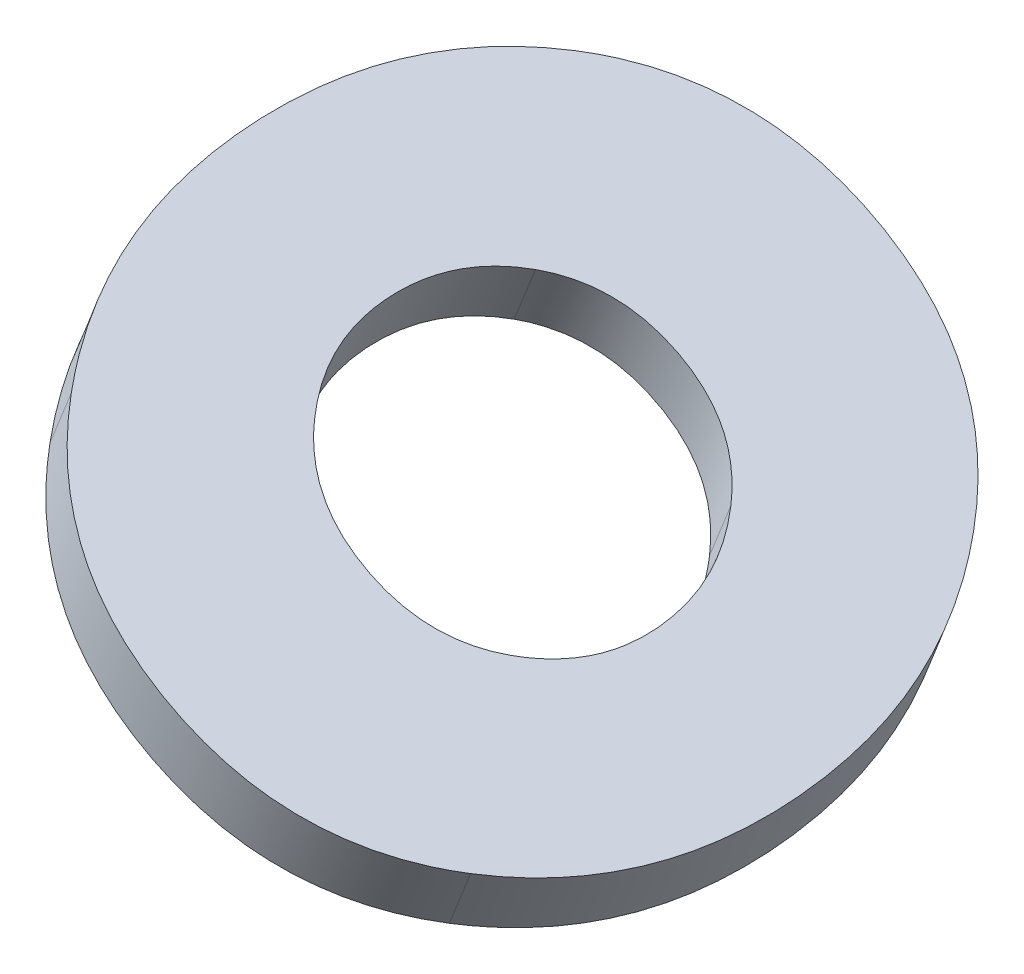
ISO-10303-21;
HEADER;
FILE_DESCRIPTION(('STEP AP214'),'2;1');
FILE_NAME('part.step','',(''),(''),'','','');
FILE_SCHEMA(('AUTOMOTIVE_DESIGN { 1 0 10303 214 1 1 1 1 }'));
ENDSEC;
DATA;
#1=APPLICATION_CONTEXT('core data for automotive mechanical design processes');
#2=APPLICATION_PROTOCOL_DEFINITION('international standard','automotive_design',2000,#1);
#3=PRODUCT_CONTEXT('',#1,'mechanical');
#4=PRODUCT('Part','Part','',(#3));
#5=PRODUCT_RELATED_PRODUCT_CATEGORY('part','',(#4));
#6=PRODUCT_DEFINITION_FORMATION('','',#4);
#7=PRODUCT_DEFINITION_CONTEXT('part definition',#1,'design');
#8=PRODUCT_DEFINITION('design','',#6,#7);
#9=PRODUCT_DEFINITION_SHAPE('','',#8);
#10=(LENGTH_UNIT() NAMED_UNIT(*) SI_UNIT(.MILLI.,.METRE.));
#11=(NAMED_UNIT(*) PLANE_ANGLE_UNIT() SI_UNIT($,.RADIAN.));
#12=(NAMED_UNIT(*) SI_UNIT($,.STERADIAN.) SOLID_ANGLE_UNIT());
#13=UNCERTAINTY_MEASURE_WITH_UNIT(LENGTH_MEASURE(1.E-05),#10,'distance_accuracy_value','');
#14=(GEOMETRIC_REPRESENTATION_CONTEXT(3) GLOBAL_UNCERTAINTY_ASSIGNED_CONTEXT((#13)) GLOBAL_UNIT_ASSIGNED_CONTEXT((#10,
#11,#12)) REPRESENTATION_CONTEXT('',''));
#15=CARTESIAN_POINT('',(0.,0.,0.));
#16=DIRECTION('',(0.,0.,1.));
#17=DIRECTION('',(1.,0.,0.));
#18=AXIS2_PLACEMENT_3D('',#15,#16,#17);
#19=CARTESIAN_POINT('',(3.98840341875596,7.59742136184228,1.56870581639864));
#20=CARTESIAN_POINT('',(3.98454172250193,7.59859341821891,1.5723983942653));
#21=CARTESIAN_POINT('',(3.93095712458151,7.61453372846904,1.62485927126845));
#22=CARTESIAN_POINT('',(3.8701626621407,7.6258530152977,1.70999151573043));
#23=CARTESIAN_POINT('',(3.82449729426318,7.61913640139894,1.83155130656556));
#24=CARTESIAN_POINT('',(3.80577850812356,7.60343258203057,1.9304060214411));
#25=CARTESIAN_POINT('',(3.80359954941392,7.57884733920706,2.02806318926111));
#26=CARTESIAN_POINT('',(3.82403076189053,7.53651426311101,2.14530846126991));
#27=CARTESIAN_POINT('',(3.86704977882298,7.4907771970366,2.22788875573318));
#28=CARTESIAN_POINT('',(3.90972979560977,7.45353372467327,2.27902928680717));
#29=CARTESIAN_POINT('',(3.91287913451842,7.45081476499334,2.28269231112175));
#30=(BOUNDED_CURVE() B_SPLINE_CURVE(3,(#19,#20,#21,#22,#23,#24,#25,#26,#27,#28,#29),
.UNSPECIFIED.,.F.,.F.) B_SPLINE_CURVE_WITH_KNOTS((4,1,1,1,1,1,1,1,4),(0.,0.01874487802913,
0.2642575080465,0.3870138230553,0.509770138064,0.6277397872326,0.7457094364012,0.9816487347385,
1.),.UNSPECIFIED.) CURVE() GEOMETRIC_REPRESENTATION_ITEM() RATIONAL_B_SPLINE_CURVE((1.,1.,1.,1.,
1.,1.,1.,1.,1.,1.,1.)) REPRESENTATION_ITEM(''));
#31=DIRECTION('',(-0.473549457311715,-0.851557509516818,-0.224946036785035));
#32=VECTOR('',#31,1.);
#33=SURFACE_OF_LINEAR_EXTRUSION('',#30,#32);
#34=DIRECTION('',(-0.473549457311715,-0.851557509516818,-0.224946036785035));
#35=VECTOR('',#34,1.);
#36=CARTESIAN_POINT('',(4.01488447409671,7.66893812649616,1.59786513260996));
#37=LINE('',#36,#35);
#38=CARTESIAN_POINT('',(4.01488447409671,7.66893812649616,1.59786513260996));
#39=VERTEX_POINT('',#38);
#40=CARTESIAN_POINT('',(3.87440631171502,7.41632410223279,1.5311350257648));
#41=VERTEX_POINT('',#40);
#42=EDGE_CURVE('E11',#39,#41,#37,.T.);
#43=ORIENTED_EDGE('',*,*,#42,.F.);
#44=CARTESIAN_POINT('',(3.94152284960082,7.52700253828279,2.28961625524368));
#45=CARTESIAN_POINT('',(3.90281303229783,7.56115649223782,2.24181348820375));
#46=CARTESIAN_POINT('',(3.86191471847543,7.60463886387229,2.16330414421274));
#47=CARTESIAN_POINT('',(3.84148350599882,7.64697193996833,2.04605887220394));
#48=CARTESIAN_POINT('',(3.84366246470846,7.67155718279185,1.94840170438393));
#49=CARTESIAN_POINT('',(3.86238125084808,7.68726100216021,1.84954698950839));
#50=CARTESIAN_POINT('',(3.90804661872608,7.69397761605986,1.72798719867324));
#51=CARTESIAN_POINT('',(3.96589652281886,7.68320657489593,1.64697830444759));
#52=CARTESIAN_POINT('',(4.01488447409671,7.66893812649616,1.59786513260996));
#53=B_SPLINE_CURVE_WITH_KNOTS('',3,(#44,#45,#46,#47,#48,#49,#50,#51,#52),.UNSPECIFIED.,.F.,.F.,
(4,1,1,1,1,1,4),(0.,0.2450289265053,0.3675433897579,0.4900578530105,0.6175433897579,
0.7450289265053,1.),.UNSPECIFIED.);
#54=CARTESIAN_POINT('',(3.94152284960082,7.52700253828279,2.28961625524368));
#55=VERTEX_POINT('',#54);
#56=EDGE_CURVE('E140',#55,#39,#53,.T.);
#57=ORIENTED_EDGE('',*,*,#56,.F.);
#58=DIRECTION('',(0.473549457311715,0.851557509516818,0.224946036785035));
#59=VECTOR('',#58,1.);
#60=CARTESIAN_POINT('',(3.80104468721914,7.27438851401942,2.22288614839853));
#61=LINE('',#60,#59);
#62=CARTESIAN_POINT('',(3.80104468721914,7.27438851401942,2.22288614839853));
#63=VERTEX_POINT('',#62);
#64=EDGE_CURVE('E134',#63,#55,#61,.T.);
#65=ORIENTED_EDGE('',*,*,#64,.F.);
#66=CARTESIAN_POINT('',(3.87440631171502,7.41632410223279,1.5311350257648));
#67=CARTESIAN_POINT('',(3.8254183604367,7.4305925506317,1.58024819760346));
#68=CARTESIAN_POINT('',(3.76756845634391,7.44136359179561,1.66125709182811));
#69=CARTESIAN_POINT('',(3.72190308846641,7.43464697789685,1.78281688266424));
#70=CARTESIAN_POINT('',(3.70318430232679,7.41894315852849,1.88167159753978));
#71=CARTESIAN_POINT('',(3.70100534361666,7.3943579157041,1.97932876535981));
#72=CARTESIAN_POINT('',(3.72143655609327,7.35202483960805,2.09657403736861));
#73=CARTESIAN_POINT('',(3.76233486991566,7.30854246797357,2.17508338135861));
#74=CARTESIAN_POINT('',(3.80104468721914,7.27438851401942,2.22288614839853));
#75=B_SPLINE_CURVE_WITH_KNOTS('',3,(#66,#67,#68,#69,#70,#71,#72,#73,#74),.UNSPECIFIED.,.F.,.F.,
(4,1,1,1,1,1,4),(0.,0.2549710734947,0.3824566102421,0.5099421469895,0.6324566102421,
0.7549710734947,1.),.UNSPECIFIED.);
#76=EDGE_CURVE('E117',#41,#63,#75,.T.);
#77=ORIENTED_EDGE('',*,*,#76,.F.);
#78=EDGE_LOOP('',(#43,#57,#65,#77));
#79=FACE_BOUND('',#78,.T.);
#80=ADVANCED_FACE('F17',(#79),#33,.T.);
#81=CARTESIAN_POINT('',(4.65860554349506,7.21958360829606,1.58816258929639));
#82=CARTESIAN_POINT('',(4.6557656893121,7.22218705355856,1.58428533958281));
#83=CARTESIAN_POINT('',(4.61491935851723,7.25913869948266,1.53038932982162));
#84=CARTESIAN_POINT('',(4.54215957492464,7.31488574383891,1.47252452630459));
#85=CARTESIAN_POINT('',(4.42840485974139,7.38770802771996,1.43632082530262));
#86=CARTESIAN_POINT('',(4.32944787653727,7.44497821184412,1.42783954820647));
#87=CARTESIAN_POINT('',(4.22853265952526,7.49847246132611,1.43777489279443));
#88=CARTESIAN_POINT('',(4.10694402567188,7.55618720551523,1.47525413836206));
#89=CARTESIAN_POINT('',(4.02180141003117,7.58812741832083,1.53358062211914));
#90=CARTESIAN_POINT('',(3.96947612799486,7.60297600361062,1.58752326888085));
#91=CARTESIAN_POINT('',(3.96575896255466,7.60400353355732,1.59145870534027));
#92=(BOUNDED_CURVE() B_SPLINE_CURVE(3,(#81,#82,#83,#84,#85,#86,#87,#88,#89,#90,#91),
.UNSPECIFIED.,.F.,.F.) B_SPLINE_CURVE_WITH_KNOTS((4,1,1,1,1,1,1,1,4),(0.,0.01828981753048,
0.2590324096191,0.3794037056635,0.4997750017078,0.6201870218203,0.7405990419328,0.9814230821579,
1.),.UNSPECIFIED.) CURVE() GEOMETRIC_REPRESENTATION_ITEM() RATIONAL_B_SPLINE_CURVE((1.,1.,1.,1.,
1.,1.,1.,1.,1.,1.,1.)) REPRESENTATION_ITEM(''));
#93=DIRECTION('',(-0.473549457311715,-0.851557509516818,-0.224946036785035));
#94=VECTOR('',#93,1.);
#95=SURFACE_OF_LINEAR_EXTRUSION('',#92,#94);
#96=DIRECTION('',(-0.473549457311715,-0.851557509516818,-0.224946036785035));
#97=VECTOR('',#96,1.);
#98=CARTESIAN_POINT('',(4.68783745345294,7.29553536242519,1.59474175972551));
#99=LINE('',#98,#97);
#100=CARTESIAN_POINT('',(4.68783745345294,7.29553536242519,1.59474175972551));
#101=VERTEX_POINT('',#100);
#102=CARTESIAN_POINT('',(4.54735929107125,7.04292133816182,1.52801165288036));
#103=VERTEX_POINT('',#102);
#104=EDGE_CURVE('E30',#101,#103,#99,.T.);
#105=ORIENTED_EDGE('',*,*,#104,.F.);
#106=CARTESIAN_POINT('',(4.01488447409671,7.66893812649616,1.59786513260996));
#107=CARTESIAN_POINT('',(4.06384975136949,7.65468980098143,1.54872351603399));
#108=CARTESIAN_POINT('',(4.14482798225678,7.62431180627651,1.49324982130488));
#109=CARTESIAN_POINT('',(4.26641661611016,7.56659706208739,1.45577057573726));
#110=CARTESIAN_POINT('',(4.36733183312265,7.51310281260627,1.44583523114928));
#111=CARTESIAN_POINT('',(4.46628881632629,7.45583262848123,1.45431650824544));
#112=CARTESIAN_POINT('',(4.58004353150954,7.38301034460019,1.49052020924742));
#113=CARTESIAN_POINT('',(4.64929580279876,7.3299506837718,1.54559553896138));
#114=CARTESIAN_POINT('',(4.68783745345294,7.29553536242519,1.59474175972551));
#115=B_SPLINE_CURVE_WITH_KNOTS('',3,(#106,#107,#108,#109,#110,#111,#112,#113,#114),
.UNSPECIFIED.,.F.,.F.,(4,1,1,1,1,1,4),(0.,0.2500422829007,0.3750634243511,0.5000845658014,
0.6250634243511,0.7500422829007,1.),.UNSPECIFIED.);
#116=EDGE_CURVE('E174',#39,#101,#115,.T.);
#117=ORIENTED_EDGE('',*,*,#116,.F.);
#118=ORIENTED_EDGE('',*,*,#42,.T.);
#119=CARTESIAN_POINT('',(4.54735929107125,7.04292133816182,1.52801165288036));
#120=CARTESIAN_POINT('',(4.50881764041706,7.07733665950843,1.47886543211623));
#121=CARTESIAN_POINT('',(4.43956536912786,7.13039632033682,1.42379010240227));
#122=CARTESIAN_POINT('',(4.32581065394413,7.203218604217,1.38758640140131));
#123=CARTESIAN_POINT('',(4.22685367074049,7.26048878834204,1.37910512430514));
#124=CARTESIAN_POINT('',(4.12593845372798,7.31398303782314,1.38904046889213));
#125=CARTESIAN_POINT('',(4.0043498198751,7.37169778201315,1.42651971446073));
#126=CARTESIAN_POINT('',(3.92337158898781,7.40207577671808,1.48199340918984));
#127=CARTESIAN_POINT('',(3.87440631171502,7.41632410223279,1.5311350257648));
#128=B_SPLINE_CURVE_WITH_KNOTS('',3,(#119,#120,#121,#122,#123,#124,#125,#126,#127),
.UNSPECIFIED.,.F.,.F.,(4,1,1,1,1,1,4),(0.,0.2499577170993,0.3749365756489,0.4999154341986,
0.6249365756489,0.7499577170993,1.),.UNSPECIFIED.);
#129=EDGE_CURVE('E124',#103,#41,#128,.T.);
#130=ORIENTED_EDGE('',*,*,#129,.F.);
#131=EDGE_LOOP('',(#105,#117,#118,#130));
#132=FACE_BOUND('',#131,.T.);
#133=ADVANCED_FACE('F303',(#132),#95,.T.);
#134=CARTESIAN_POINT('',(4.56562482215313,7.08968782955645,2.27563723069512));
#135=CARTESIAN_POINT('',(4.56948446240153,7.08851938574811,2.27193530529957));
#136=CARTESIAN_POINT('',(4.62306461450611,7.07260288628915,2.21939364917152));
#137=CARTESIAN_POINT('',(4.68365348935994,7.06097579385287,2.13585943271438));
#138=CARTESIAN_POINT('',(4.72890052885988,7.06662707501247,2.01921322598224));
#139=CARTESIAN_POINT('',(4.74726377836331,7.08177476485487,1.92321226423011));
#140=CARTESIAN_POINT('',(4.74930255087842,7.1062451308866,1.82628509056233));
#141=CARTESIAN_POINT('',(4.72923923392874,7.1490850246467,1.70634672325139));
#142=CARTESIAN_POINT('',(4.68643097760534,7.19523928356031,1.62174341351766));
#143=CARTESIAN_POINT('',(4.64396950947155,7.2327221280242,1.56923663163203));
#144=CARTESIAN_POINT('',(4.64087677224657,7.23542319699783,1.56552217839629));
#145=(BOUNDED_CURVE() B_SPLINE_CURVE(3,(#134,#135,#136,#137,#138,#139,#140,#141,#142,#143,#144),
.UNSPECIFIED.,.F.,.F.) B_SPLINE_CURVE_WITH_KNOTS((4,1,1,1,1,1,1,1,4),(0.,0.01799938022081,
0.2539067888298,0.3718604931342,0.4898141974387,0.6126486357471,0.7354830740555,0.9811519506723,
1.),.UNSPECIFIED.) CURVE() GEOMETRIC_REPRESENTATION_ITEM() RATIONAL_B_SPLINE_CURVE((1.,1.,1.,1.,
1.,1.,1.,1.,1.,1.,1.)) REPRESENTATION_ITEM(''));
#146=DIRECTION('',(-0.473549457311715,-0.851557509516818,-0.224946036785035));
#147=VECTOR('',#146,1.);
#148=SURFACE_OF_LINEAR_EXTRUSION('',#145,#147);
#149=DIRECTION('',(-0.473549457311715,-0.851557509516818,-0.224946036785035));
#150=VECTOR('',#149,1.);
#151=CARTESIAN_POINT('',(4.61490362302147,7.15442744402669,2.28245907004571));
#152=LINE('',#151,#150);
#153=CARTESIAN_POINT('',(4.61490362302147,7.15442744402669,2.28245907004571));
#154=VERTEX_POINT('',#153);
#155=CARTESIAN_POINT('',(4.47442546063978,6.90181341976332,2.21572896320056));
#156=VERTEX_POINT('',#155);
#157=EDGE_CURVE('E136',#154,#156,#152,.T.);
#158=ORIENTED_EDGE('',*,*,#157,.F.);
#159=CARTESIAN_POINT('',(4.68783745345294,7.29553536242519,1.59474175972551));
#160=CARTESIAN_POINT('',(4.72639793221565,7.26111807385359,1.64385579128224));
#161=CARTESIAN_POINT('',(4.76712319051364,7.21720962540798,1.72434240619422));
#162=CARTESIAN_POINT('',(4.78718650746332,7.17436973164788,1.84428077350516));
#163=CARTESIAN_POINT('',(4.78514773494821,7.14989936561615,1.94120794717294));
#164=CARTESIAN_POINT('',(4.76678448544478,7.13475167577375,2.03720890892507));
#165=CARTESIAN_POINT('',(4.72153744594484,7.12910039461415,2.1538551156572));
#166=CARTESIAN_POINT('',(4.66388128972015,7.14016469411728,2.23334597673962));
#167=CARTESIAN_POINT('',(4.61490362302147,7.15442744402669,2.28245907004571));
#168=B_SPLINE_CURVE_WITH_KNOTS('',3,(#159,#160,#161,#162,#163,#164,#165,#166,#167),
.UNSPECIFIED.,.F.,.F.,(4,1,1,1,1,1,4),(0.,0.2550674567599,0.3826011851398,0.5101349135198,
0.6326011851398,0.7550674567599,1.),.UNSPECIFIED.);
#169=EDGE_CURVE('E168',#101,#154,#168,.T.);
#170=ORIENTED_EDGE('',*,*,#169,.F.);
#171=ORIENTED_EDGE('',*,*,#104,.T.);
#172=CARTESIAN_POINT('',(4.47442546063978,6.90181341976332,2.21572896320056));
#173=CARTESIAN_POINT('',(4.52340312733847,6.88755066985392,2.16661586989547));
#174=CARTESIAN_POINT('',(4.58105928356268,6.87648637034991,2.08712500881307));
#175=CARTESIAN_POINT('',(4.6263063230631,6.88213765151039,1.97047880208092));
#176=CARTESIAN_POINT('',(4.64466957256605,6.89728534135192,1.87447784032881));
#177=CARTESIAN_POINT('',(4.64670834508165,6.92175570738452,1.77755066666101));
#178=CARTESIAN_POINT('',(4.62664502813195,6.96459560114461,1.65761229934907));
#179=CARTESIAN_POINT('',(4.58591976983347,7.00850404958934,1.57712568443711));
#180=CARTESIAN_POINT('',(4.54735929107125,7.04292133816182,1.52801165288036));
#181=B_SPLINE_CURVE_WITH_KNOTS('',3,(#172,#173,#174,#175,#176,#177,#178,#179,#180),
.UNSPECIFIED.,.F.,.F.,(4,1,1,1,1,1,4),(0.,0.2449325432401,0.3673988148602,0.4898650864802,
0.6173988148602,0.7449325432401,1.),.UNSPECIFIED.);
#182=EDGE_CURVE('E229',#156,#103,#181,.T.);
#183=ORIENTED_EDGE('',*,*,#182,.F.);
#184=EDGE_LOOP('',(#158,#170,#171,#183));
#185=FACE_BOUND('',#184,.T.);
#186=ADVANCED_FACE('F294',(#185),#148,.T.);
#187=CARTESIAN_POINT('',(4.1973311902248,7.18416535962942,3.04894358364423));
#188=DIRECTION('',(0.473549457311715,0.851557509516818,0.224946036785035));
#189=DIRECTION('',(0.429072446904516,0.,-0.903270078828792));
#190=AXIS2_PLACEMENT_3D('',#187,#188,#189);
#191=PLANE('',#190);
#192=ORIENTED_EDGE('',*,*,#56,.T.);
#193=ORIENTED_EDGE('',*,*,#116,.T.);
#194=ORIENTED_EDGE('',*,*,#169,.T.);
#195=CARTESIAN_POINT('',(4.61490362302147,7.15442744402669,2.28245907004571));
#196=CARTESIAN_POINT('',(4.56594104837136,7.16868099841062,2.33157520269444));
#197=CARTESIAN_POINT('',(4.4849676139787,7.19906326910401,2.387022612777));
#198=CARTESIAN_POINT('',(4.36339743226832,7.25676466592301,2.42451354137416));
#199=CARTESIAN_POINT('',(4.26249301076664,7.31026706542986,2.43439530678412));
#200=CARTESIAN_POINT('',(4.16350992289977,7.36749948031656,2.42611196394878));
#201=CARTESIAN_POINT('',(4.04962607407985,7.4401209717771,2.39094023248231));
#202=CARTESIAN_POINT('',(3.98021005479737,7.49286882697039,2.33738999388866));
#203=CARTESIAN_POINT('',(3.94152284960082,7.52700253828279,2.28961625524368));
#204=B_SPLINE_CURVE_WITH_KNOTS('',3,(#195,#196,#197,#198,#199,#200,#201,#202,#203),
.UNSPECIFIED.,.F.,.F.,(4,1,1,1,1,1,4),(0.,0.2499577170993,0.3749365756489,0.4999154341986,
0.6249365756489,0.7499577170993,1.),.UNSPECIFIED.);
#205=EDGE_CURVE('E21',#154,#55,#204,.T.);
#206=ORIENTED_EDGE('',*,*,#205,.T.);
#207=EDGE_LOOP('',(#192,#193,#194,#206));
#208=FACE_BOUND('',#207,.T.);
#209=CARTESIAN_POINT('',(4.91531989210053,6.87101867052063,2.72290651943456));
#210=CARTESIAN_POINT('',(5.01546980184844,6.8437507155507,2.61529980658591));
#211=CARTESIAN_POINT('',(5.13427900531514,6.82501325384698,2.43611902092593));
#212=CARTESIAN_POINT('',(5.22966718176601,6.84372063434246,2.16449196579023));
#213=CARTESIAN_POINT('',(5.27034873675185,6.88105549780376,1.93751525455843));
#214=CARTESIAN_POINT('',(5.2778480068893,6.93706241628254,1.70970778548074));
#215=CARTESIAN_POINT('',(5.2404498785573,7.03035149229407,1.43528130195667));
#216=CARTESIAN_POINT('',(5.15964177782375,7.1226858448442,1.25585436193235));
#217=CARTESIAN_POINT('',(5.08224323491015,7.19397175411213,1.14893088059355));
#218=B_SPLINE_CURVE_WITH_KNOTS('',3,(#209,#210,#211,#212,#213,#214,#215,#216,#217),
.UNSPECIFIED.,.F.,.F.,(4,1,1,1,1,1,4),(0.,0.2478597745824,0.3717896618736,0.4957195491648,
0.6217896618736,0.7478597745824,1.),.UNSPECIFIED.);
#219=CARTESIAN_POINT('',(4.91531989210053,6.87101867052063,2.72290651943456));
#220=VERTEX_POINT('',#219);
#221=CARTESIAN_POINT('',(5.08224323491015,7.19397175411213,1.14893088059355));
#222=VERTEX_POINT('',#221);
#223=EDGE_CURVE('E75',#220,#222,#218,.T.);
#224=ORIENTED_EDGE('',*,*,#223,.T.);
#225=CARTESIAN_POINT('',(5.08224323491015,7.19397175411213,1.14893088059355));
#226=CARTESIAN_POINT('',(5.00485724397651,7.26524995260205,1.04201016519573));
#227=CARTESIAN_POINT('',(4.86509082625741,7.37464234928803,0.922125387468414));
#228=CARTESIAN_POINT('',(4.63439856152152,7.52377493043428,0.843214138924985));
#229=CARTESIAN_POINT('',(4.43260291825653,7.64090847410653,0.824606425566145));
#230=CARTESIAN_POINT('',(4.22608466285962,7.75000566109231,0.846363105490466));
#231=CARTESIAN_POINT('',(3.97677081241688,7.8668484614112,0.92888989635396));
#232=CARTESIAN_POINT('',(3.81087154233345,7.92681466509517,1.05112738337604));
#233=CARTESIAN_POINT('',(3.71065055639594,7.95394510619687,1.15940429722436));
#234=B_SPLINE_CURVE_WITH_KNOTS('',3,(#225,#226,#227,#228,#229,#230,#231,#232,#233),
.UNSPECIFIED.,.F.,.F.,(4,1,1,1,1,1,4),(0.,0.2489010483723,0.3733515725585,0.4978020967446,
0.6233515725585,0.7489010483723,1.),.UNSPECIFIED.);
#235=CARTESIAN_POINT('',(3.71065055639594,7.95394510619687,1.15940429722436));
#236=VERTEX_POINT('',#235);
#237=EDGE_CURVE('E59',#222,#236,#234,.T.);
#238=ORIENTED_EDGE('',*,*,#237,.T.);
#239=CARTESIAN_POINT('',(3.71065055639594,7.95394510619687,1.15940429722436));
#240=CARTESIAN_POINT('',(3.61045240701811,7.98106213803102,1.26768389848109));
#241=CARTESIAN_POINT('',(3.49142528060057,7.99945267474404,1.44863677082063));
#242=CARTESIAN_POINT('',(3.39569504145287,7.97992748889902,1.72407981624376));
#243=CARTESIAN_POINT('',(3.35483971725998,7.94240252399868,1.95214199056795));
#244=CARTESIAN_POINT('',(3.34741417044907,7.88664114047383,2.17886476049885));
#245=CARTESIAN_POINT('',(3.38531443488671,7.79408117618802,2.44947403142253));
#246=CARTESIAN_POINT('',(3.4662804310428,7.70212700873752,2.62712934313466));
#247=CARTESIAN_POINT('',(3.54372721358631,7.63099202260537,2.73337993606537));
#248=B_SPLINE_CURVE_WITH_KNOTS('',3,(#239,#240,#241,#242,#243,#244,#245,#246,#247),
.UNSPECIFIED.,.F.,.F.,(4,1,1,1,1,1,4),(0.,0.2521402254176,0.3782103381264,0.5042804508352,
0.6282103381264,0.7521402254176,1.),.UNSPECIFIED.);
#249=CARTESIAN_POINT('',(3.54372721358631,7.63099202260537,2.73337993606537));
#250=VERTEX_POINT('',#249);
#251=EDGE_CURVE('E66',#236,#250,#248,.T.);
#252=ORIENTED_EDGE('',*,*,#251,.T.);
#253=CARTESIAN_POINT('',(3.54372721358631,7.63099202260537,2.73337993606537));
#254=CARTESIAN_POINT('',(3.62119409899033,7.5598383382115,2.83965899336654));
#255=CARTESIAN_POINT('',(3.76149416243272,7.45034435379257,2.95880492791206));
#256=CARTESIAN_POINT('',(3.99374924308319,7.30049728807877,3.03713094307231));
#257=CARTESIAN_POINT('',(4.19599830621596,7.18314032877516,3.05562989491002));
#258=CARTESIAN_POINT('',(4.40205656206064,7.07425382744933,3.03404401853612));
#259=CARTESIAN_POINT('',(4.64981812408364,6.95814587965173,2.95200319380875));
#260=CARTESIAN_POINT('',(4.81517980063339,6.89827362571838,2.83054177518622));
#261=CARTESIAN_POINT('',(4.91531989210053,6.87101867052063,2.72290651943456));
#262=B_SPLINE_CURVE_WITH_KNOTS('',3,(#253,#254,#255,#256,#257,#258,#259,#260,#261),
.UNSPECIFIED.,.F.,.F.,(4,1,1,1,1,1,4),(0.,0.2510989516277,0.3766484274415,0.5021979032554,
0.6266484274415,0.7510989516277,1.),.UNSPECIFIED.);
#263=EDGE_CURVE('E155',#250,#220,#262,.T.);
#264=ORIENTED_EDGE('',*,*,#263,.T.);
#265=EDGE_LOOP('',(#224,#238,#252,#264));
#266=FACE_BOUND('',#265,.T.);
#267=ADVANCED_FACE('F292',(#208,#266),#191,.T.);
#268=CARTESIAN_POINT('',(5.0351403972639,7.13428281072014,1.11840840990512));
#269=CARTESIAN_POINT('',(5.03824957730747,7.13145595562485,1.12256442516527));
#270=CARTESIAN_POINT('',(5.11964414344562,7.05697641123403,1.23316545225701));
#271=CARTESIAN_POINT('',(5.20256592197241,6.96222689153279,1.41728561901384));
#272=CARTESIAN_POINT('',(5.2399640503044,6.86893781552127,1.69171210253792));
#273=CARTESIAN_POINT('',(5.23246478016695,6.81293089704249,1.9195195716156));
#274=CARTESIAN_POINT('',(5.19178322518111,6.77559603358118,2.1464962828474));
#275=CARTESIAN_POINT('',(5.09639504873024,6.75688865308571,2.4181233379831));
#276=CARTESIAN_POINT('',(4.97445454879538,6.77611995319514,2.60202655376497));
#277=CARTESIAN_POINT('',(4.86948464783027,6.80507315951631,2.71340046248922));
#278=CARTESIAN_POINT('',(4.86545990847373,6.80619735835469,2.71761744354241));
#279=(BOUNDED_CURVE() B_SPLINE_CURVE(3,(#268,#269,#270,#271,#272,#273,#274,#275,#276,#277,#278),
.UNSPECIFIED.,.F.,.F.) B_SPLINE_CURVE_WITH_KNOTS((4,1,1,1,1,1,1,1,4),(0.,0.009701714101542,
0.256972795524,0.3806083362352,0.5042438769465,0.6257805226773,0.7473171684081,0.9903904598697,
1.),.UNSPECIFIED.) CURVE() GEOMETRIC_REPRESENTATION_ITEM() RATIONAL_B_SPLINE_CURVE((1.,1.,1.,1.,
1.,1.,1.,1.,1.,1.,1.)) REPRESENTATION_ITEM(''));
#280=DIRECTION('',(-0.473549457311715,-0.851557509516818,-0.224946036785035));
#281=VECTOR('',#280,1.);
#282=SURFACE_OF_LINEAR_EXTRUSION('',#279,#281);
#283=DIRECTION('',(-0.473549457311715,-0.851557509516818,-0.224946036785035));
#284=VECTOR('',#283,1.);
#285=CARTESIAN_POINT('',(5.08224323491015,7.19397175411213,1.14893088059355));
#286=LINE('',#285,#284);
#287=CARTESIAN_POINT('',(4.94176507252799,6.94135772984789,1.08220077374942));
#288=VERTEX_POINT('',#287);
#289=EDGE_CURVE('E164',#222,#288,#286,.T.);
#290=ORIENTED_EDGE('',*,*,#289,.F.);
#291=ORIENTED_EDGE('',*,*,#223,.F.);
#292=DIRECTION('',(0.473549457311715,0.851557509516818,0.224946036785035));
#293=VECTOR('',#292,1.);
#294=CARTESIAN_POINT('',(4.77484172971884,6.61840464625727,2.65617641258941));
#295=LINE('',#294,#293);
#296=CARTESIAN_POINT('',(4.77484172971884,6.61840464625727,2.65617641258941));
#297=VERTEX_POINT('',#296);
#298=EDGE_CURVE('E128',#297,#220,#295,.T.);
#299=ORIENTED_EDGE('',*,*,#298,.F.);
#300=CARTESIAN_POINT('',(4.94176507252799,6.94135772984789,1.08220077374942));
#301=CARTESIAN_POINT('',(5.01916361544158,6.87007182057996,1.18912425508721));
#302=CARTESIAN_POINT('',(5.09997171617561,6.77773746803069,1.36855119511151));
#303=CARTESIAN_POINT('',(5.13736984450763,6.68444839201918,1.64297767863659));
#304=CARTESIAN_POINT('',(5.12987057437017,6.6284414735404,1.87078514771428));
#305=CARTESIAN_POINT('',(5.08918901938385,6.59110661007822,2.0977618589461));
#306=CARTESIAN_POINT('',(4.99380084293345,6.57239922958362,2.36938891408077));
#307=CARTESIAN_POINT('',(4.87499163946675,6.59113669128732,2.54856969974076));
#308=CARTESIAN_POINT('',(4.77484172971884,6.61840464625727,2.65617641258941));
#309=B_SPLINE_CURVE_WITH_KNOTS('',3,(#300,#301,#302,#303,#304,#305,#306,#307,#308),
.UNSPECIFIED.,.F.,.F.,(4,1,1,1,1,1,4),(0.,0.2521402254176,0.3782103381264,0.5042804508352,
0.6282103381264,0.7521402254176,1.),.UNSPECIFIED.);
#310=EDGE_CURVE('E246',#288,#297,#309,.T.);
#311=ORIENTED_EDGE('',*,*,#310,.F.);
#312=EDGE_LOOP('',(#290,#291,#299,#311));
#313=FACE_BOUND('',#312,.T.);
#314=ADVANCED_FACE('F289',(#313),#282,.T.);
#315=CARTESIAN_POINT('',(3.66111665166672,7.88892862510147,1.1541676031485));
#316=CARTESIAN_POINT('',(3.66498421968632,7.88791205156494,1.14987406714621));
#317=CARTESIAN_POINT('',(3.76868477032869,7.86024536657045,1.03630209017523));
#318=CARTESIAN_POINT('',(3.93888685583198,7.79872386064992,0.910894213411131));
#319=CARTESIAN_POINT('',(4.18820070627472,7.68188106033103,0.828367422547639));
#320=CARTESIAN_POINT('',(4.39471896167163,7.57278387334525,0.806610742623315));
#321=CARTESIAN_POINT('',(4.59651460493662,7.455650329673,0.825218455982154));
#322=CARTESIAN_POINT('',(4.82720686967251,7.30651774852675,0.904129704525586));
#323=CARTESIAN_POINT('',(4.97061782677522,7.19427284331563,1.02714058937584));
#324=CARTESIAN_POINT('',(5.05038885391973,7.12027374174744,1.13934067249252));
#325=CARTESIAN_POINT('',(5.05336734179666,7.11749085598638,1.14360536621387));
#326=(BOUNDED_CURVE() B_SPLINE_CURVE(3,(#315,#316,#317,#318,#319,#320,#321,#322,#323,#324,#325),
.UNSPECIFIED.,.F.,.F.) B_SPLINE_CURVE_WITH_KNOTS((4,1,1,1,1,1,1,1,4),(0.,0.009581981139178,
0.2558771037366,0.3790246650353,0.5021722263339,0.6242418602892,0.7463114942445,0.990450762155,
1.),.UNSPECIFIED.) CURVE() GEOMETRIC_REPRESENTATION_ITEM() RATIONAL_B_SPLINE_CURVE((1.,1.,1.,1.,
1.,1.,1.,1.,1.,1.,1.)) REPRESENTATION_ITEM(''));
#327=DIRECTION('',(-0.473549457311715,-0.851557509516818,-0.224946036785035));
#328=VECTOR('',#327,1.);
#329=SURFACE_OF_LINEAR_EXTRUSION('',#326,#328);
#330=DIRECTION('',(-0.473549457311715,-0.851557509516818,-0.224946036785035));
#331=VECTOR('',#330,1.);
#332=CARTESIAN_POINT('',(3.71065055639594,7.95394510619687,1.15940429722436));
#333=LINE('',#332,#331);
#334=CARTESIAN_POINT('',(3.57017239401378,7.70133108193263,1.09267419038023));
#335=VERTEX_POINT('',#334);
#336=EDGE_CURVE('E158',#236,#335,#333,.T.);
#337=ORIENTED_EDGE('',*,*,#336,.F.);
#338=ORIENTED_EDGE('',*,*,#237,.F.);
#339=ORIENTED_EDGE('',*,*,#289,.T.);
#340=CARTESIAN_POINT('',(3.57017239401378,7.70133108193263,1.09267419038023));
#341=CARTESIAN_POINT('',(3.67039337995129,7.67420064083093,0.98439727653191));
#342=CARTESIAN_POINT('',(3.83629265003519,7.61423443714783,0.862159789508809));
#343=CARTESIAN_POINT('',(4.08560650047793,7.49739163682894,0.779632998645313));
#344=CARTESIAN_POINT('',(4.29212475587436,7.38829444984229,0.757876318721012));
#345=CARTESIAN_POINT('',(4.49392039913983,7.27116090617091,0.776484032079833));
#346=CARTESIAN_POINT('',(4.72461266387524,7.12202832502379,0.85539528062328));
#347=CARTESIAN_POINT('',(4.86437908159435,7.01263592833781,0.975280058351593));
#348=CARTESIAN_POINT('',(4.94176507252799,6.94135772984789,1.08220077374942));
#349=B_SPLINE_CURVE_WITH_KNOTS('',3,(#340,#341,#342,#343,#344,#345,#346,#347,#348),
.UNSPECIFIED.,.F.,.F.,(4,1,1,1,1,1,4),(0.,0.2510989516277,0.3766484274415,0.5021979032554,
0.6266484274415,0.7510989516277,1.),.UNSPECIFIED.);
#350=EDGE_CURVE('E255',#335,#288,#349,.T.);
#351=ORIENTED_EDGE('',*,*,#350,.F.);
#352=EDGE_LOOP('',(#337,#338,#339,#351));
#353=FACE_BOUND('',#352,.T.);
#354=ADVANCED_FACE('F287',(#353),#329,.T.);
#355=CARTESIAN_POINT('',(3.51509901500247,7.55442052365941,2.72787596199497));
#356=CARTESIAN_POINT('',(3.51197738478636,7.55725138681436,2.72373098350859));
#357=CARTESIAN_POINT('',(3.43052142096746,7.63158907773405,2.61379621055095));
#358=CARTESIAN_POINT('',(3.34743047830181,7.72595657542674,2.43147834847971));
#359=CARTESIAN_POINT('',(3.30953021386417,7.81851653971255,2.16086907755602));
#360=CARTESIAN_POINT('',(3.31695576067509,7.8742779232374,1.93414630762512));
#361=CARTESIAN_POINT('',(3.35781108486797,7.91180288813775,1.70608413330093));
#362=CARTESIAN_POINT('',(3.45354132401567,7.93132807398276,1.43064108787781));
#363=CARTESIAN_POINT('',(3.57569475162764,7.91245450152247,1.24493540667847));
#364=CARTESIAN_POINT('',(3.68069420729298,7.88366072142373,1.13289575513154));
#365=CARTESIAN_POINT('',(3.68470654017658,7.88254622757572,1.12866815251437));
#366=(BOUNDED_CURVE() B_SPLINE_CURVE(3,(#355,#356,#357,#358,#359,#360,#361,#362,#363,#364,#365),
.UNSPECIFIED.,.F.,.F.) B_SPLINE_CURVE_WITH_KNOTS((4,1,1,1,1,1,1,1,4),(0.,0.009569161124287,
0.2526424681161,0.374179121612,0.4957157751079,0.6193513237183,0.7429868723288,0.9902579695496,
1.),.UNSPECIFIED.) CURVE() GEOMETRIC_REPRESENTATION_ITEM() RATIONAL_B_SPLINE_CURVE((1.,1.,1.,1.,
1.,1.,1.,1.,1.,1.,1.)) REPRESENTATION_ITEM(''));
#367=DIRECTION('',(-0.473549457311715,-0.851557509516818,-0.224946036785035));
#368=VECTOR('',#367,1.);
#369=SURFACE_OF_LINEAR_EXTRUSION('',#366,#368);
#370=DIRECTION('',(-0.473549457311715,-0.851557509516818,-0.224946036785035));
#371=VECTOR('',#370,1.);
#372=CARTESIAN_POINT('',(3.54372721358631,7.63099202260537,2.73337993606537));
#373=LINE('',#372,#371);
#374=CARTESIAN_POINT('',(3.40324905120462,7.37837799834201,2.66664982922022));
#375=VERTEX_POINT('',#374);
#376=EDGE_CURVE('E161',#250,#375,#373,.T.);
#377=ORIENTED_EDGE('',*,*,#376,.F.);
#378=ORIENTED_EDGE('',*,*,#251,.F.);
#379=ORIENTED_EDGE('',*,*,#336,.T.);
#380=CARTESIAN_POINT('',(3.40324905120462,7.37837799834201,2.66664982922022));
#381=CARTESIAN_POINT('',(3.32580226866111,7.44951298447415,2.56039923628951));
#382=CARTESIAN_POINT('',(3.24483627250502,7.54146715192465,2.38274392457738));
#383=CARTESIAN_POINT('',(3.20693600806691,7.6340271162096,2.11213465365471));
#384=CARTESIAN_POINT('',(3.21436155487831,7.68978849973532,1.8854118837238));
#385=CARTESIAN_POINT('',(3.25521687907119,7.72731346463566,1.65734970939961));
#386=CARTESIAN_POINT('',(3.35094711821888,7.74683865048066,1.38190666397548));
#387=CARTESIAN_POINT('',(3.46997424463593,7.72844811376678,1.20095379163596));
#388=CARTESIAN_POINT('',(3.57017239401378,7.70133108193263,1.09267419038023));
#389=B_SPLINE_CURVE_WITH_KNOTS('',3,(#380,#381,#382,#383,#384,#385,#386,#387,#388),
.UNSPECIFIED.,.F.,.F.,(4,1,1,1,1,1,4),(0.,0.2478597745824,0.3717896618736,0.4957195491648,
0.6217896618736,0.7478597745824,1.),.UNSPECIFIED.);
#390=EDGE_CURVE('E138',#375,#335,#389,.T.);
#391=ORIENTED_EDGE('',*,*,#390,.F.);
#392=EDGE_LOOP('',(#377,#378,#379,#391));
#393=FACE_BOUND('',#392,.T.);
#394=ADVANCED_FACE('F284',(#393),#369,.T.);
#395=CARTESIAN_POINT('',(4.88910196597614,6.79976415359668,2.69220050462081));
#396=CARTESIAN_POINT('',(4.88522868150726,6.80078819484628,2.69647780488179));
#397=CARTESIAN_POINT('',(4.78159369067551,6.82859291008158,2.80938923897872));
#398=CARTESIAN_POINT('',(4.61193416749874,6.89002127889045,2.93400751086592));
#399=CARTESIAN_POINT('',(4.36417260547574,7.00612922668805,3.01604833559329));
#400=CARTESIAN_POINT('',(4.15811434963106,7.11501572801388,3.03763421196719));
#401=CARTESIAN_POINT('',(3.95586528649829,7.2323726873175,3.01913526012948));
#402=CARTESIAN_POINT('',(3.72361020584782,7.3822197530313,2.94080924496923));
#403=CARTESIAN_POINT('',(3.57964479116943,7.49457427721885,2.81855061262618));
#404=CARTESIAN_POINT('',(3.49979644268246,7.56844128106178,2.70701337421621));
#405=CARTESIAN_POINT('',(3.49681010517318,7.5712239333745,2.70276608904636));
#406=(BOUNDED_CURVE() B_SPLINE_CURVE(3,(#395,#396,#397,#398,#399,#400,#401,#402,#403,#404,#405),
.UNSPECIFIED.,.F.,.F.) B_SPLINE_CURVE_WITH_KNOTS((4,1,1,1,1,1,1,1,4),(0.,0.009517617109828,
0.2536474893537,0.3757124254757,0.4977773615977,0.6209201835792,0.7440630055607,0.9903486495237,
1.),.UNSPECIFIED.) CURVE() GEOMETRIC_REPRESENTATION_ITEM() RATIONAL_B_SPLINE_CURVE((1.,1.,1.,1.,
1.,1.,1.,1.,1.,1.,1.)) REPRESENTATION_ITEM(''));
#407=DIRECTION('',(-0.473549457311715,-0.851557509516818,-0.224946036785035));
#408=VECTOR('',#407,1.);
#409=SURFACE_OF_LINEAR_EXTRUSION('',#406,#408);
#410=ORIENTED_EDGE('',*,*,#298,.T.);
#411=ORIENTED_EDGE('',*,*,#263,.F.);
#412=ORIENTED_EDGE('',*,*,#376,.T.);
#413=CARTESIAN_POINT('',(4.77484172971884,6.61840464625727,2.65617641258941));
#414=CARTESIAN_POINT('',(4.6747016382517,6.64565960145501,2.76381166834107));
#415=CARTESIAN_POINT('',(4.50933996170195,6.70553185538836,2.8852730869636));
#416=CARTESIAN_POINT('',(4.26157839967896,6.82163980318597,2.96731391169197));
#417=CARTESIAN_POINT('',(4.05552014383427,6.93052630451179,2.98889978806487));
#418=CARTESIAN_POINT('',(3.8532710807015,7.0478832638154,2.97040083622716));
#419=CARTESIAN_POINT('',(3.62101600005055,7.19773032952833,2.89207482106692));
#420=CARTESIAN_POINT('',(3.48071593660864,7.30722431394813,2.77292888652139));
#421=CARTESIAN_POINT('',(3.40324905120462,7.37837799834201,2.66664982922022));
#422=B_SPLINE_CURVE_WITH_KNOTS('',3,(#413,#414,#415,#416,#417,#418,#419,#420,#421),
.UNSPECIFIED.,.F.,.F.,(4,1,1,1,1,1,4),(0.,0.2489010483723,0.3733515725585,0.4978020967446,
0.6233515725585,0.7489010483723,1.),.UNSPECIFIED.);
#423=EDGE_CURVE('E237',#297,#375,#422,.T.);
#424=ORIENTED_EDGE('',*,*,#423,.F.);
#425=EDGE_LOOP('',(#410,#411,#412,#424));
#426=FACE_BOUND('',#425,.T.);
#427=ADVANCED_FACE('F291',(#426),#409,.T.);
#428=CARTESIAN_POINT('',(4.05685302784265,6.93155133536518,2.9822134768001));
#429=DIRECTION('',(0.473549457311715,0.851557509516818,0.224946036785035));
#430=DIRECTION('',(0.429072446904516,0.,-0.903270078828792));
#431=AXIS2_PLACEMENT_3D('',#428,#429,#430);
#432=PLANE('',#431);
#433=ORIENTED_EDGE('',*,*,#182,.T.);
#434=ORIENTED_EDGE('',*,*,#129,.T.);
#435=ORIENTED_EDGE('',*,*,#76,.T.);
#436=CARTESIAN_POINT('',(3.80104468721914,7.27438851401942,2.22288614839853));
#437=CARTESIAN_POINT('',(3.8397318924152,7.24025480270614,2.27065988704352));
#438=CARTESIAN_POINT('',(3.90914791169818,7.18750694751374,2.32421012563815));
#439=CARTESIAN_POINT('',(4.02303176051808,7.11488545605319,2.35938185710363));
#440=CARTESIAN_POINT('',(4.12201484838495,7.05765304116649,2.36766519993897));
#441=CARTESIAN_POINT('',(4.22291926988663,7.00415064165965,2.35778343452901));
#442=CARTESIAN_POINT('',(4.34448945159703,6.94644924484066,2.32029250593285));
#443=CARTESIAN_POINT('',(4.42546288598969,6.91606697414727,2.26484509585028));
#444=CARTESIAN_POINT('',(4.47442546063978,6.90181341976332,2.21572896320056));
#445=B_SPLINE_CURVE_WITH_KNOTS('',3,(#436,#437,#438,#439,#440,#441,#442,#443,#444),
.UNSPECIFIED.,.F.,.F.,(4,1,1,1,1,1,4),(0.,0.2500422829007,0.3750634243511,0.5000845658014,
0.6250634243511,0.7500422829007,1.),.UNSPECIFIED.);
#446=EDGE_CURVE('E122',#63,#156,#445,.T.);
#447=ORIENTED_EDGE('',*,*,#446,.T.);
#448=EDGE_LOOP('',(#433,#434,#435,#447));
#449=FACE_BOUND('',#448,.T.);
#450=ORIENTED_EDGE('',*,*,#390,.T.);
#451=ORIENTED_EDGE('',*,*,#350,.T.);
#452=ORIENTED_EDGE('',*,*,#310,.T.);
#453=ORIENTED_EDGE('',*,*,#423,.T.);
#454=EDGE_LOOP('',(#450,#451,#452,#453));
#455=FACE_BOUND('',#454,.T.);
#456=ADVANCED_FACE('F120',(#449,#455),#432,.F.);
#457=CARTESIAN_POINT('',(3.8947875102625,7.46678951366787,2.26030410450923));
#458=CARTESIAN_POINT('',(3.89769230106866,7.46415859106108,2.26414867010218));
#459=CARTESIAN_POINT('',(3.9387422376019,7.42746753074919,2.31662958037288));
#460=CARTESIAN_POINT('',(4.01174211749495,7.37199637101582,2.37294454953948));
#461=CARTESIAN_POINT('',(4.12562596631487,7.29937487955528,2.40811628100595));
#462=CARTESIAN_POINT('',(4.22460905418174,7.24214246466858,2.41639962384129));
#463=CARTESIAN_POINT('',(4.32551347568342,7.18864006516174,2.40651785843133));
#464=CARTESIAN_POINT('',(4.4470836573938,7.13093866834274,2.36902692983417));
#465=CARTESIAN_POINT('',(4.53224218905815,7.0989860954984,2.31071373041731));
#466=CARTESIAN_POINT('',(4.58458136095915,7.08412883674236,2.25677467748505));
#467=CARTESIAN_POINT('',(4.58831672617146,7.08309606552628,2.25282076881727));
#468=(BOUNDED_CURVE() B_SPLINE_CURVE(3,(#457,#458,#459,#460,#461,#462,#463,#464,#465,#466,#467),
.UNSPECIFIED.,.F.,.F.) B_SPLINE_CURVE_WITH_KNOTS((4,1,1,1,1,1,1,1,4),(0.,0.01864181469654,
0.2593581276617,0.3797162841443,0.5000744406269,0.6203918912583,0.7407093418897,0.9813442431525,
1.),.UNSPECIFIED.) CURVE() GEOMETRIC_REPRESENTATION_ITEM() RATIONAL_B_SPLINE_CURVE((1.,1.,1.,1.,
1.,1.,1.,1.,1.,1.,1.)) REPRESENTATION_ITEM(''));
#469=DIRECTION('',(-0.473549457311715,-0.851557509516818,-0.224946036785035));
#470=VECTOR('',#469,1.);
#471=SURFACE_OF_LINEAR_EXTRUSION('',#468,#470);
#472=ORIENTED_EDGE('',*,*,#64,.T.);
#473=ORIENTED_EDGE('',*,*,#205,.F.);
#474=ORIENTED_EDGE('',*,*,#157,.T.);
#475=ORIENTED_EDGE('',*,*,#446,.F.);
#476=EDGE_LOOP('',(#472,#473,#474,#475));
#477=FACE_BOUND('',#476,.T.);
#478=ADVANCED_FACE('F132',(#477),#471,.T.);
#479=CLOSED_SHELL('',(#80,#133,#186,#267,#314,#354,#394,#427,#456,#478));
#480=MANIFOLD_SOLID_BREP('B1',#479);
#481=ADVANCED_BREP_SHAPE_REPRESENTATION('',(#18,#480),#14);
#482=SHAPE_DEFINITION_REPRESENTATION(#9,#481);
ENDSEC;
END-ISO-10303-21;
